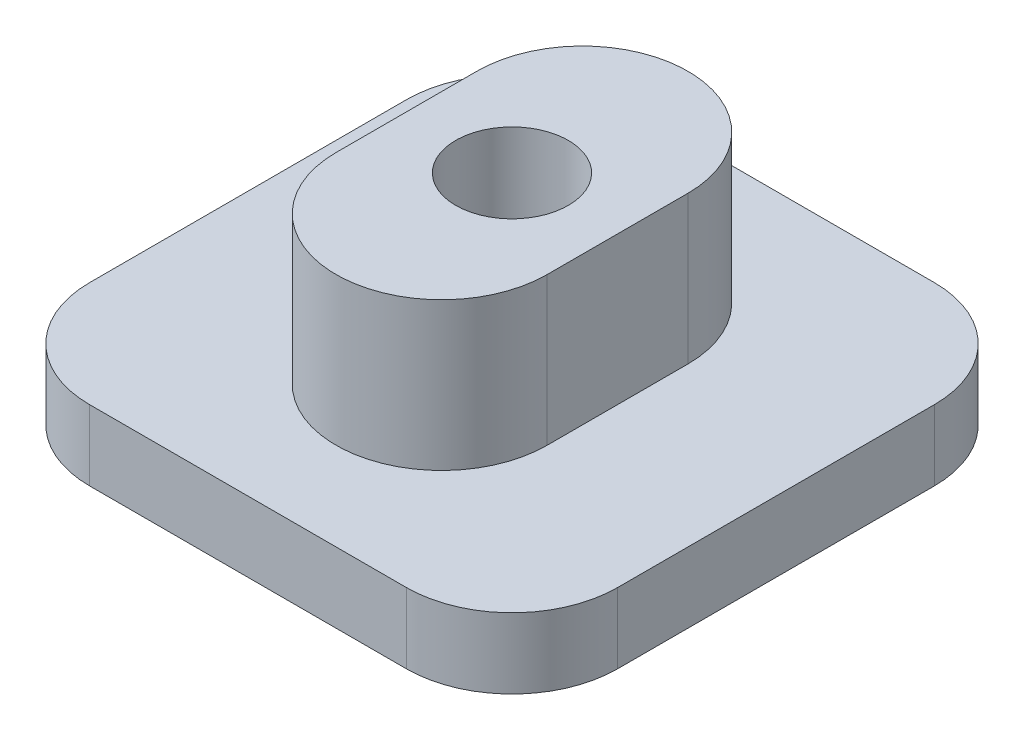
ISO-10303-21;
HEADER;
FILE_DESCRIPTION(('STEP AP214'),'2;1');
FILE_NAME('part.step','',(''),(''),'','','');
FILE_SCHEMA(('AUTOMOTIVE_DESIGN { 1 0 10303 214 1 1 1 1 }'));
ENDSEC;
DATA;
#1=APPLICATION_CONTEXT('core data for automotive mechanical design processes');
#2=APPLICATION_PROTOCOL_DEFINITION('international standard','automotive_design',2000,#1);
#3=PRODUCT_CONTEXT('',#1,'mechanical');
#4=PRODUCT('Part','Part','',(#3));
#5=PRODUCT_RELATED_PRODUCT_CATEGORY('part','',(#4));
#6=PRODUCT_DEFINITION_FORMATION('','',#4);
#7=PRODUCT_DEFINITION_CONTEXT('part definition',#1,'design');
#8=PRODUCT_DEFINITION('design','',#6,#7);
#9=PRODUCT_DEFINITION_SHAPE('','',#8);
#10=(LENGTH_UNIT() NAMED_UNIT(*) SI_UNIT(.MILLI.,.METRE.));
#11=(NAMED_UNIT(*) PLANE_ANGLE_UNIT() SI_UNIT($,.RADIAN.));
#12=(NAMED_UNIT(*) SI_UNIT($,.STERADIAN.) SOLID_ANGLE_UNIT());
#13=UNCERTAINTY_MEASURE_WITH_UNIT(LENGTH_MEASURE(1.E-05),#10,'distance_accuracy_value','');
#14=(GEOMETRIC_REPRESENTATION_CONTEXT(3) GLOBAL_UNCERTAINTY_ASSIGNED_CONTEXT((#13)) GLOBAL_UNIT_ASSIGNED_CONTEXT((#10,
#11,#12)) REPRESENTATION_CONTEXT('',''));
#15=CARTESIAN_POINT('',(0.,0.,0.));
#16=DIRECTION('',(0.,0.,1.));
#17=DIRECTION('',(1.,0.,0.));
#18=AXIS2_PLACEMENT_3D('',#15,#16,#17);
#19=CARTESIAN_POINT('',(0.,4.2,2.));
#20=DIRECTION('',(0.,1.,0.));
#21=DIRECTION('',(0.,0.,1.));
#22=AXIS2_PLACEMENT_3D('',#19,#20,#21);
#23=PLANE('',#22);
#24=CARTESIAN_POINT('',(0.,4.2,2.));
#25=DIRECTION('',(0.,1.,0.));
#26=DIRECTION('',(0.,0.,1.));
#27=AXIS2_PLACEMENT_3D('',#24,#25,#26);
#28=CIRCLE('',#27,3.);
#29=CARTESIAN_POINT('',(-3.,4.2,2.));
#30=VERTEX_POINT('',#29);
#31=CARTESIAN_POINT('',(3.,4.2,2.));
#32=VERTEX_POINT('',#31);
#33=EDGE_CURVE('E160',#30,#32,#28,.T.);
#34=ORIENTED_EDGE('',*,*,#33,.T.);
#35=DIRECTION('',(0.,0.,-1.));
#36=VECTOR('',#35,1.);
#37=CARTESIAN_POINT('',(3.,4.2,2.));
#38=LINE('',#37,#36);
#39=CARTESIAN_POINT('',(3.,4.2,-2.));
#40=VERTEX_POINT('',#39);
#41=EDGE_CURVE('E137',#32,#40,#38,.T.);
#42=ORIENTED_EDGE('',*,*,#41,.T.);
#43=CARTESIAN_POINT('',(0.,4.2,-2.));
#44=DIRECTION('',(0.,1.,0.));
#45=DIRECTION('',(0.,0.,1.));
#46=AXIS2_PLACEMENT_3D('',#43,#44,#45);
#47=CIRCLE('',#46,3.);
#48=CARTESIAN_POINT('',(-3.,4.2,-2.));
#49=VERTEX_POINT('',#48);
#50=EDGE_CURVE('E214',#40,#49,#47,.T.);
#51=ORIENTED_EDGE('',*,*,#50,.T.);
#52=DIRECTION('',(0.,0.,1.));
#53=VECTOR('',#52,1.);
#54=CARTESIAN_POINT('',(-3.,4.2,2.));
#55=LINE('',#54,#53);
#56=EDGE_CURVE('E154',#49,#30,#55,.T.);
#57=ORIENTED_EDGE('',*,*,#56,.T.);
#58=EDGE_LOOP('',(#34,#42,#51,#57));
#59=FACE_BOUND('',#58,.T.);
#60=CARTESIAN_POINT('',(0.,4.2,0.));
#61=DIRECTION('',(0.,1.,0.));
#62=DIRECTION('',(0.,0.,1.));
#63=AXIS2_PLACEMENT_3D('',#60,#61,#62);
#64=CIRCLE('',#63,1.6);
#65=CARTESIAN_POINT('',(0.,4.2,1.6));
#66=VERTEX_POINT('',#65);
#67=EDGE_CURVE('E148',#66,#66,#64,.T.);
#68=ORIENTED_EDGE('',*,*,#67,.F.);
#69=EDGE_LOOP('',(#68));
#70=FACE_BOUND('',#69,.T.);
#71=ADVANCED_FACE('F33',(#59,#70),#23,.T.);
#72=CARTESIAN_POINT('',(0.,4.2,2.));
#73=DIRECTION('',(0.,-1.,0.));
#74=DIRECTION('',(0.,0.,-1.));
#75=AXIS2_PLACEMENT_3D('',#72,#73,#74);
#76=CYLINDRICAL_SURFACE('',#75,3.);
#77=CARTESIAN_POINT('',(0.,0.,2.));
#78=DIRECTION('',(0.,1.,0.));
#79=DIRECTION('',(0.,0.,1.));
#80=AXIS2_PLACEMENT_3D('',#77,#78,#79);
#81=CIRCLE('',#80,3.);
#82=CARTESIAN_POINT('',(-3.,0.,2.));
#83=VERTEX_POINT('',#82);
#84=CARTESIAN_POINT('',(3.,0.,2.));
#85=VERTEX_POINT('',#84);
#86=EDGE_CURVE('E126',#83,#85,#81,.T.);
#87=ORIENTED_EDGE('',*,*,#86,.T.);
#88=DIRECTION('',(0.,-1.,0.));
#89=VECTOR('',#88,1.);
#90=CARTESIAN_POINT('',(3.,4.2,2.));
#91=LINE('',#90,#89);
#92=EDGE_CURVE('E135',#32,#85,#91,.T.);
#93=ORIENTED_EDGE('',*,*,#92,.F.);
#94=ORIENTED_EDGE('',*,*,#33,.F.);
#95=DIRECTION('',(0.,-1.,0.));
#96=VECTOR('',#95,1.);
#97=CARTESIAN_POINT('',(-3.,4.2,2.));
#98=LINE('',#97,#96);
#99=EDGE_CURVE('E147',#30,#83,#98,.T.);
#100=ORIENTED_EDGE('',*,*,#99,.T.);
#101=EDGE_LOOP('',(#87,#93,#94,#100));
#102=FACE_BOUND('',#101,.T.);
#103=ADVANCED_FACE('F145',(#102),#76,.T.);
#104=CARTESIAN_POINT('',(3.,4.2,2.));
#105=DIRECTION('',(-1.,0.,0.));
#106=DIRECTION('',(0.,0.,1.));
#107=AXIS2_PLACEMENT_3D('',#104,#105,#106);
#108=PLANE('',#107);
#109=DIRECTION('',(0.,0.,-1.));
#110=VECTOR('',#109,1.);
#111=CARTESIAN_POINT('',(3.,0.,2.));
#112=LINE('',#111,#110);
#113=CARTESIAN_POINT('',(3.,0.,-2.));
#114=VERTEX_POINT('',#113);
#115=EDGE_CURVE('E121',#85,#114,#112,.T.);
#116=ORIENTED_EDGE('',*,*,#115,.T.);
#117=DIRECTION('',(0.,-1.,0.));
#118=VECTOR('',#117,1.);
#119=CARTESIAN_POINT('',(3.,4.2,-2.));
#120=LINE('',#119,#118);
#121=EDGE_CURVE('E142',#40,#114,#120,.T.);
#122=ORIENTED_EDGE('',*,*,#121,.F.);
#123=ORIENTED_EDGE('',*,*,#41,.F.);
#124=ORIENTED_EDGE('',*,*,#92,.T.);
#125=EDGE_LOOP('',(#116,#122,#123,#124));
#126=FACE_BOUND('',#125,.T.);
#127=ADVANCED_FACE('F136',(#126),#108,.F.);
#128=CARTESIAN_POINT('',(0.,4.2,-2.));
#129=DIRECTION('',(0.,-1.,0.));
#130=DIRECTION('',(0.,0.,-1.));
#131=AXIS2_PLACEMENT_3D('',#128,#129,#130);
#132=CYLINDRICAL_SURFACE('',#131,3.);
#133=CARTESIAN_POINT('',(0.,0.,-2.));
#134=DIRECTION('',(0.,1.,0.));
#135=DIRECTION('',(0.,0.,1.));
#136=AXIS2_PLACEMENT_3D('',#133,#134,#135);
#137=CIRCLE('',#136,3.);
#138=CARTESIAN_POINT('',(-3.,0.,-2.));
#139=VERTEX_POINT('',#138);
#140=EDGE_CURVE('E129',#114,#139,#137,.T.);
#141=ORIENTED_EDGE('',*,*,#140,.T.);
#142=DIRECTION('',(0.,-1.,0.));
#143=VECTOR('',#142,1.);
#144=CARTESIAN_POINT('',(-3.,4.2,-2.));
#145=LINE('',#144,#143);
#146=EDGE_CURVE('E162',#49,#139,#145,.T.);
#147=ORIENTED_EDGE('',*,*,#146,.F.);
#148=ORIENTED_EDGE('',*,*,#50,.F.);
#149=ORIENTED_EDGE('',*,*,#121,.T.);
#150=EDGE_LOOP('',(#141,#147,#148,#149));
#151=FACE_BOUND('',#150,.T.);
#152=ADVANCED_FACE('F223',(#151),#132,.T.);
#153=CARTESIAN_POINT('',(-3.,4.2,2.));
#154=DIRECTION('',(1.,0.,0.));
#155=DIRECTION('',(0.,0.,-1.));
#156=AXIS2_PLACEMENT_3D('',#153,#154,#155);
#157=PLANE('',#156);
#158=DIRECTION('',(0.,0.,1.));
#159=VECTOR('',#158,1.);
#160=CARTESIAN_POINT('',(-3.,0.,2.));
#161=LINE('',#160,#159);
#162=EDGE_CURVE('E158',#139,#83,#161,.T.);
#163=ORIENTED_EDGE('',*,*,#162,.T.);
#164=ORIENTED_EDGE('',*,*,#99,.F.);
#165=ORIENTED_EDGE('',*,*,#56,.F.);
#166=ORIENTED_EDGE('',*,*,#146,.T.);
#167=EDGE_LOOP('',(#163,#164,#165,#166));
#168=FACE_BOUND('',#167,.T.);
#169=ADVANCED_FACE('F221',(#168),#157,.F.);
#170=CARTESIAN_POINT('',(0.,4.2,0.));
#171=DIRECTION('',(0.,-1.,0.));
#172=DIRECTION('',(0.,0.,-1.));
#173=AXIS2_PLACEMENT_3D('',#170,#171,#172);
#174=CYLINDRICAL_SURFACE('',#173,1.6);
#175=ORIENTED_EDGE('',*,*,#67,.T.);
#176=EDGE_LOOP('',(#175));
#177=FACE_BOUND('',#176,.T.);
#178=CARTESIAN_POINT('',(0.,-2.,0.));
#179=DIRECTION('',(0.,1.,0.));
#180=DIRECTION('',(0.,0.,1.));
#181=AXIS2_PLACEMENT_3D('',#178,#179,#180);
#182=CIRCLE('',#181,1.6);
#183=CARTESIAN_POINT('',(0.,-2.,1.6));
#184=VERTEX_POINT('',#183);
#185=EDGE_CURVE('E267',#184,#184,#182,.T.);
#186=ORIENTED_EDGE('',*,*,#185,.F.);
#187=EDGE_LOOP('',(#186));
#188=FACE_BOUND('',#187,.T.);
#189=ADVANCED_FACE('F230',(#177,#188),#174,.F.);
#190=CARTESIAN_POINT('',(-7.5,-2.,7.5));
#191=DIRECTION('',(1.,0.,0.));
#192=DIRECTION('',(0.,0.,-1.));
#193=AXIS2_PLACEMENT_3D('',#190,#191,#192);
#194=PLANE('',#193);
#195=DIRECTION('',(0.,0.,-1.));
#196=VECTOR('',#195,1.);
#197=CARTESIAN_POINT('',(-7.5,0.,7.5));
#198=LINE('',#197,#196);
#199=CARTESIAN_POINT('',(-7.5,0.,4.5));
#200=VERTEX_POINT('',#199);
#201=CARTESIAN_POINT('',(-7.5,0.,-4.5));
#202=VERTEX_POINT('',#201);
#203=EDGE_CURVE('E282',#200,#202,#198,.T.);
#204=ORIENTED_EDGE('',*,*,#203,.T.);
#205=DIRECTION('',(0.,1.,0.));
#206=VECTOR('',#205,1.);
#207=CARTESIAN_POINT('',(-7.5,-2.,-4.5));
#208=LINE('',#207,#206);
#209=CARTESIAN_POINT('',(-7.5,-2.,-4.5));
#210=VERTEX_POINT('',#209);
#211=EDGE_CURVE('E193',#202,#210,#208,.F.);
#212=ORIENTED_EDGE('',*,*,#211,.T.);
#213=DIRECTION('',(0.,0.,-1.));
#214=VECTOR('',#213,1.);
#215=CARTESIAN_POINT('',(-7.5,-2.,7.5));
#216=LINE('',#215,#214);
#217=CARTESIAN_POINT('',(-7.5,-2.,4.5));
#218=VERTEX_POINT('',#217);
#219=EDGE_CURVE('E203',#218,#210,#216,.T.);
#220=ORIENTED_EDGE('',*,*,#219,.F.);
#221=DIRECTION('',(0.,1.,0.));
#222=VECTOR('',#221,1.);
#223=CARTESIAN_POINT('',(-7.5,-2.,4.5));
#224=LINE('',#223,#222);
#225=EDGE_CURVE('E190',#218,#200,#224,.T.);
#226=ORIENTED_EDGE('',*,*,#225,.T.);
#227=EDGE_LOOP('',(#204,#212,#220,#226));
#228=FACE_BOUND('',#227,.T.);
#229=ADVANCED_FACE('F242',(#228),#194,.F.);
#230=CARTESIAN_POINT('',(7.5,-2.,-7.5));
#231=DIRECTION('',(0.,0.,1.));
#232=DIRECTION('',(1.,0.,0.));
#233=AXIS2_PLACEMENT_3D('',#230,#231,#232);
#234=PLANE('',#233);
#235=DIRECTION('',(1.,0.,0.));
#236=VECTOR('',#235,1.);
#237=CARTESIAN_POINT('',(7.5,0.,-7.5));
#238=LINE('',#237,#236);
#239=CARTESIAN_POINT('',(-4.5,0.,-7.5));
#240=VERTEX_POINT('',#239);
#241=CARTESIAN_POINT('',(4.5,0.,-7.5));
#242=VERTEX_POINT('',#241);
#243=EDGE_CURVE('E209',#240,#242,#238,.T.);
#244=ORIENTED_EDGE('',*,*,#243,.T.);
#245=DIRECTION('',(0.,1.,0.));
#246=VECTOR('',#245,1.);
#247=CARTESIAN_POINT('',(4.5,-2.,-7.5));
#248=LINE('',#247,#246);
#249=CARTESIAN_POINT('',(4.5,-2.,-7.5));
#250=VERTEX_POINT('',#249);
#251=EDGE_CURVE('E181',#242,#250,#248,.F.);
#252=ORIENTED_EDGE('',*,*,#251,.T.);
#253=DIRECTION('',(1.,0.,0.));
#254=VECTOR('',#253,1.);
#255=CARTESIAN_POINT('',(7.5,-2.,-7.5));
#256=LINE('',#255,#254);
#257=CARTESIAN_POINT('',(-4.5,-2.,-7.5));
#258=VERTEX_POINT('',#257);
#259=EDGE_CURVE('E207',#258,#250,#256,.T.);
#260=ORIENTED_EDGE('',*,*,#259,.F.);
#261=DIRECTION('',(0.,1.,0.));
#262=VECTOR('',#261,1.);
#263=CARTESIAN_POINT('',(-4.5,-2.,-7.5));
#264=LINE('',#263,#262);
#265=EDGE_CURVE('E178',#258,#240,#264,.T.);
#266=ORIENTED_EDGE('',*,*,#265,.T.);
#267=EDGE_LOOP('',(#244,#252,#260,#266));
#268=FACE_BOUND('',#267,.T.);
#269=ADVANCED_FACE('F246',(#268),#234,.F.);
#270=CARTESIAN_POINT('',(7.5,-2.,7.5));
#271=DIRECTION('',(-1.,0.,0.));
#272=DIRECTION('',(0.,0.,1.));
#273=AXIS2_PLACEMENT_3D('',#270,#271,#272);
#274=PLANE('',#273);
#275=DIRECTION('',(0.,0.,1.));
#276=VECTOR('',#275,1.);
#277=CARTESIAN_POINT('',(7.5,-2.,7.5));
#278=LINE('',#277,#276);
#279=CARTESIAN_POINT('',(7.5,-2.,-4.5));
#280=VERTEX_POINT('',#279);
#281=CARTESIAN_POINT('',(7.5,-2.,4.5));
#282=VERTEX_POINT('',#281);
#283=EDGE_CURVE('E274',#280,#282,#278,.T.);
#284=ORIENTED_EDGE('',*,*,#283,.F.);
#285=DIRECTION('',(0.,1.,0.));
#286=VECTOR('',#285,1.);
#287=CARTESIAN_POINT('',(7.5,-2.,-4.5));
#288=LINE('',#287,#286);
#289=CARTESIAN_POINT('',(7.5,0.,-4.5));
#290=VERTEX_POINT('',#289);
#291=EDGE_CURVE('E167',#280,#290,#288,.T.);
#292=ORIENTED_EDGE('',*,*,#291,.T.);
#293=DIRECTION('',(0.,0.,1.));
#294=VECTOR('',#293,1.);
#295=CARTESIAN_POINT('',(7.5,0.,7.5));
#296=LINE('',#295,#294);
#297=CARTESIAN_POINT('',(7.5,0.,4.5));
#298=VERTEX_POINT('',#297);
#299=EDGE_CURVE('E204',#290,#298,#296,.T.);
#300=ORIENTED_EDGE('',*,*,#299,.T.);
#301=DIRECTION('',(0.,1.,0.));
#302=VECTOR('',#301,1.);
#303=CARTESIAN_POINT('',(7.5,-2.,4.5));
#304=LINE('',#303,#302);
#305=EDGE_CURVE('E141',#298,#282,#304,.F.);
#306=ORIENTED_EDGE('',*,*,#305,.T.);
#307=EDGE_LOOP('',(#284,#292,#300,#306));
#308=FACE_BOUND('',#307,.T.);
#309=ADVANCED_FACE('F250',(#308),#274,.F.);
#310=CARTESIAN_POINT('',(7.5,-2.,7.5));
#311=DIRECTION('',(0.,0.,-1.));
#312=DIRECTION('',(-1.,0.,0.));
#313=AXIS2_PLACEMENT_3D('',#310,#311,#312);
#314=PLANE('',#313);
#315=DIRECTION('',(-1.,0.,0.));
#316=VECTOR('',#315,1.);
#317=CARTESIAN_POINT('',(7.5,0.,7.5));
#318=LINE('',#317,#316);
#319=CARTESIAN_POINT('',(4.5,0.,7.5));
#320=VERTEX_POINT('',#319);
#321=CARTESIAN_POINT('',(-4.5,0.,7.5));
#322=VERTEX_POINT('',#321);
#323=EDGE_CURVE('E198',#320,#322,#318,.T.);
#324=ORIENTED_EDGE('',*,*,#323,.T.);
#325=DIRECTION('',(0.,1.,0.));
#326=VECTOR('',#325,1.);
#327=CARTESIAN_POINT('',(-4.5,-2.,7.5));
#328=LINE('',#327,#326);
#329=CARTESIAN_POINT('',(-4.5,-2.,7.5));
#330=VERTEX_POINT('',#329);
#331=EDGE_CURVE('E11',#322,#330,#328,.F.);
#332=ORIENTED_EDGE('',*,*,#331,.T.);
#333=DIRECTION('',(-1.,0.,0.));
#334=VECTOR('',#333,1.);
#335=CARTESIAN_POINT('',(7.5,-2.,7.5));
#336=LINE('',#335,#334);
#337=CARTESIAN_POINT('',(4.5,-2.,7.5));
#338=VERTEX_POINT('',#337);
#339=EDGE_CURVE('E151',#338,#330,#336,.T.);
#340=ORIENTED_EDGE('',*,*,#339,.F.);
#341=DIRECTION('',(0.,1.,0.));
#342=VECTOR('',#341,1.);
#343=CARTESIAN_POINT('',(4.5,-2.,7.5));
#344=LINE('',#343,#342);
#345=EDGE_CURVE('E41',#338,#320,#344,.T.);
#346=ORIENTED_EDGE('',*,*,#345,.T.);
#347=EDGE_LOOP('',(#324,#332,#340,#346));
#348=FACE_BOUND('',#347,.T.);
#349=ADVANCED_FACE('F197',(#348),#314,.F.);
#350=CARTESIAN_POINT('',(0.,-2.,0.));
#351=DIRECTION('',(0.,1.,0.));
#352=DIRECTION('',(0.,0.,1.));
#353=AXIS2_PLACEMENT_3D('',#350,#351,#352);
#354=PLANE('',#353);
#355=ORIENTED_EDGE('',*,*,#185,.T.);
#356=EDGE_LOOP('',(#355));
#357=FACE_BOUND('',#356,.T.);
#358=ORIENTED_EDGE('',*,*,#259,.T.);
#359=CARTESIAN_POINT('',(4.5,-2.,-4.5));
#360=DIRECTION('',(0.,1.,0.));
#361=DIRECTION('',(0.,0.,1.));
#362=AXIS2_PLACEMENT_3D('',#359,#360,#361);
#363=CIRCLE('',#362,3.);
#364=EDGE_CURVE('E188',#250,#280,#363,.F.);
#365=ORIENTED_EDGE('',*,*,#364,.T.);
#366=ORIENTED_EDGE('',*,*,#283,.T.);
#367=CARTESIAN_POINT('',(4.5,-2.,4.5));
#368=DIRECTION('',(0.,1.,0.));
#369=DIRECTION('',(0.,0.,1.));
#370=AXIS2_PLACEMENT_3D('',#367,#368,#369);
#371=CIRCLE('',#370,3.);
#372=EDGE_CURVE('E53',#282,#338,#371,.F.);
#373=ORIENTED_EDGE('',*,*,#372,.T.);
#374=ORIENTED_EDGE('',*,*,#339,.T.);
#375=CARTESIAN_POINT('',(-4.5,-2.,4.5));
#376=DIRECTION('',(0.,1.,0.));
#377=DIRECTION('',(0.,0.,1.));
#378=AXIS2_PLACEMENT_3D('',#375,#376,#377);
#379=CIRCLE('',#378,3.);
#380=EDGE_CURVE('E184',#330,#218,#379,.F.);
#381=ORIENTED_EDGE('',*,*,#380,.T.);
#382=ORIENTED_EDGE('',*,*,#219,.T.);
#383=CARTESIAN_POINT('',(-4.5,-2.,-4.5));
#384=DIRECTION('',(0.,1.,0.));
#385=DIRECTION('',(0.,0.,1.));
#386=AXIS2_PLACEMENT_3D('',#383,#384,#385);
#387=CIRCLE('',#386,3.);
#388=EDGE_CURVE('E186',#210,#258,#387,.F.);
#389=ORIENTED_EDGE('',*,*,#388,.T.);
#390=EDGE_LOOP('',(#358,#365,#366,#373,#374,#381,#382,#389));
#391=FACE_BOUND('',#390,.T.);
#392=ADVANCED_FACE('F257',(#357,#391),#354,.F.);
#393=CARTESIAN_POINT('',(0.,0.,0.));
#394=DIRECTION('',(0.,1.,0.));
#395=DIRECTION('',(0.,0.,1.));
#396=AXIS2_PLACEMENT_3D('',#393,#394,#395);
#397=PLANE('',#396);
#398=ORIENTED_EDGE('',*,*,#86,.F.);
#399=ORIENTED_EDGE('',*,*,#162,.F.);
#400=ORIENTED_EDGE('',*,*,#140,.F.);
#401=ORIENTED_EDGE('',*,*,#115,.F.);
#402=EDGE_LOOP('',(#398,#399,#400,#401));
#403=FACE_BOUND('',#402,.T.);
#404=ORIENTED_EDGE('',*,*,#299,.F.);
#405=CARTESIAN_POINT('',(4.5,0.,-4.5));
#406=DIRECTION('',(0.,1.,0.));
#407=DIRECTION('',(0.,0.,1.));
#408=AXIS2_PLACEMENT_3D('',#405,#406,#407);
#409=CIRCLE('',#408,3.);
#410=EDGE_CURVE('E176',#290,#242,#409,.T.);
#411=ORIENTED_EDGE('',*,*,#410,.T.);
#412=ORIENTED_EDGE('',*,*,#243,.F.);
#413=CARTESIAN_POINT('',(-4.5,0.,-4.5));
#414=DIRECTION('',(0.,1.,0.));
#415=DIRECTION('',(0.,0.,1.));
#416=AXIS2_PLACEMENT_3D('',#413,#414,#415);
#417=CIRCLE('',#416,3.);
#418=EDGE_CURVE('E174',#240,#202,#417,.T.);
#419=ORIENTED_EDGE('',*,*,#418,.T.);
#420=ORIENTED_EDGE('',*,*,#203,.F.);
#421=CARTESIAN_POINT('',(-4.5,0.,4.5));
#422=DIRECTION('',(0.,1.,0.));
#423=DIRECTION('',(0.,0.,1.));
#424=AXIS2_PLACEMENT_3D('',#421,#422,#423);
#425=CIRCLE('',#424,3.);
#426=EDGE_CURVE('E172',#200,#322,#425,.T.);
#427=ORIENTED_EDGE('',*,*,#426,.T.);
#428=ORIENTED_EDGE('',*,*,#323,.F.);
#429=CARTESIAN_POINT('',(4.5,0.,4.5));
#430=DIRECTION('',(0.,1.,0.));
#431=DIRECTION('',(0.,0.,1.));
#432=AXIS2_PLACEMENT_3D('',#429,#430,#431);
#433=CIRCLE('',#432,3.);
#434=EDGE_CURVE('E170',#320,#298,#433,.T.);
#435=ORIENTED_EDGE('',*,*,#434,.T.);
#436=EDGE_LOOP('',(#404,#411,#412,#419,#420,#427,#428,#435));
#437=FACE_BOUND('',#436,.T.);
#438=ADVANCED_FACE('F123',(#403,#437),#397,.T.);
#439=CARTESIAN_POINT('',(4.5,-2.,-4.5));
#440=DIRECTION('',(0.,1.,0.));
#441=DIRECTION('',(0.,0.,1.));
#442=AXIS2_PLACEMENT_3D('',#439,#440,#441);
#443=CYLINDRICAL_SURFACE('',#442,3.);
#444=ORIENTED_EDGE('',*,*,#364,.F.);
#445=ORIENTED_EDGE('',*,*,#251,.F.);
#446=ORIENTED_EDGE('',*,*,#410,.F.);
#447=ORIENTED_EDGE('',*,*,#291,.F.);
#448=EDGE_LOOP('',(#444,#445,#446,#447));
#449=FACE_BOUND('',#448,.T.);
#450=ADVANCED_FACE('F260',(#449),#443,.T.);
#451=CARTESIAN_POINT('',(-4.5,-2.,-4.5));
#452=DIRECTION('',(0.,1.,0.));
#453=DIRECTION('',(0.,0.,1.));
#454=AXIS2_PLACEMENT_3D('',#451,#452,#453);
#455=CYLINDRICAL_SURFACE('',#454,3.);
#456=ORIENTED_EDGE('',*,*,#388,.F.);
#457=ORIENTED_EDGE('',*,*,#211,.F.);
#458=ORIENTED_EDGE('',*,*,#418,.F.);
#459=ORIENTED_EDGE('',*,*,#265,.F.);
#460=EDGE_LOOP('',(#456,#457,#458,#459));
#461=FACE_BOUND('',#460,.T.);
#462=ADVANCED_FACE('F293',(#461),#455,.T.);
#463=CARTESIAN_POINT('',(-4.5,-2.,4.5));
#464=DIRECTION('',(0.,1.,0.));
#465=DIRECTION('',(0.,0.,1.));
#466=AXIS2_PLACEMENT_3D('',#463,#464,#465);
#467=CYLINDRICAL_SURFACE('',#466,3.);
#468=ORIENTED_EDGE('',*,*,#380,.F.);
#469=ORIENTED_EDGE('',*,*,#331,.F.);
#470=ORIENTED_EDGE('',*,*,#426,.F.);
#471=ORIENTED_EDGE('',*,*,#225,.F.);
#472=EDGE_LOOP('',(#468,#469,#470,#471));
#473=FACE_BOUND('',#472,.T.);
#474=ADVANCED_FACE('F289',(#473),#467,.T.);
#475=CARTESIAN_POINT('',(4.5,-2.,4.5));
#476=DIRECTION('',(0.,1.,0.));
#477=DIRECTION('',(0.,0.,1.));
#478=AXIS2_PLACEMENT_3D('',#475,#476,#477);
#479=CYLINDRICAL_SURFACE('',#478,3.);
#480=ORIENTED_EDGE('',*,*,#372,.F.);
#481=ORIENTED_EDGE('',*,*,#305,.F.);
#482=ORIENTED_EDGE('',*,*,#434,.F.);
#483=ORIENTED_EDGE('',*,*,#345,.F.);
#484=EDGE_LOOP('',(#480,#481,#482,#483));
#485=FACE_BOUND('',#484,.T.);
#486=ADVANCED_FACE('F35',(#485),#479,.T.);
#487=CLOSED_SHELL('',(#71,#103,#127,#152,#169,#189,#229,#269,#309,#349,#392,#438,#450,#462,#474,#486));
#488=MANIFOLD_SOLID_BREP('B2',#487);
#489=ADVANCED_BREP_SHAPE_REPRESENTATION('',(#18,#488),#14);
#490=SHAPE_DEFINITION_REPRESENTATION(#9,#489);
ENDSEC;
END-ISO-10303-21;
